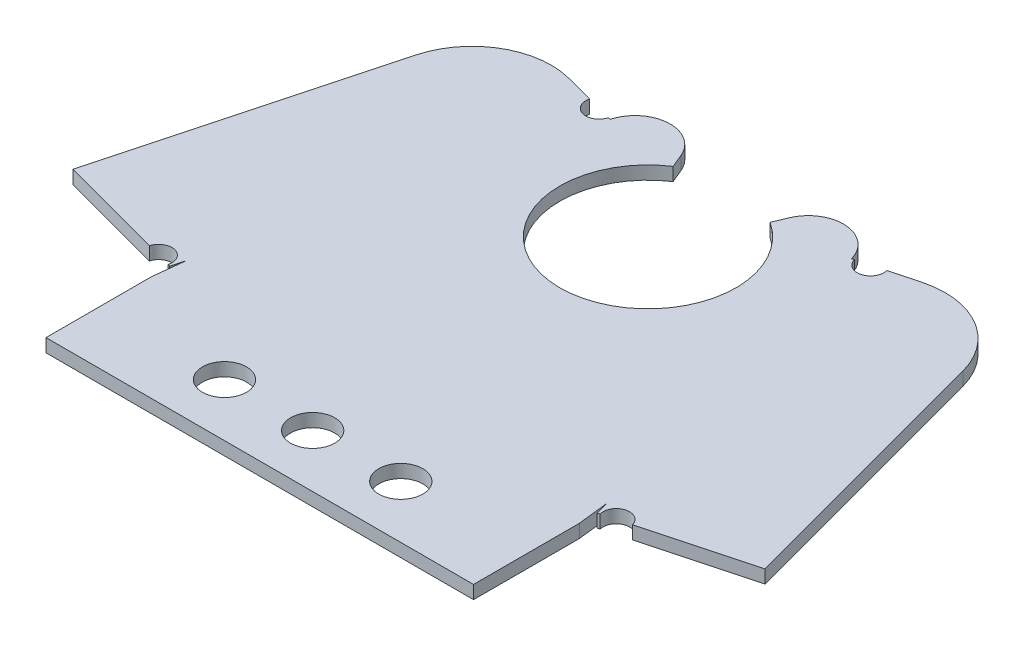
ISO-10303-21;
HEADER;
FILE_DESCRIPTION(('STEP AP214'),'2;1');
FILE_NAME('part.step','',(''),(''),'','','');
FILE_SCHEMA(('AUTOMOTIVE_DESIGN { 1 0 10303 214 1 1 1 1 }'));
ENDSEC;
DATA;
#1=APPLICATION_CONTEXT('core data for automotive mechanical design processes');
#2=APPLICATION_PROTOCOL_DEFINITION('international standard','automotive_design',2000,#1);
#3=PRODUCT_CONTEXT('',#1,'mechanical');
#4=PRODUCT('Part','Part','',(#3));
#5=PRODUCT_RELATED_PRODUCT_CATEGORY('part','',(#4));
#6=PRODUCT_DEFINITION_FORMATION('','',#4);
#7=PRODUCT_DEFINITION_CONTEXT('part definition',#1,'design');
#8=PRODUCT_DEFINITION('design','',#6,#7);
#9=PRODUCT_DEFINITION_SHAPE('','',#8);
#10=(LENGTH_UNIT() NAMED_UNIT(*) SI_UNIT(.MILLI.,.METRE.));
#11=(NAMED_UNIT(*) PLANE_ANGLE_UNIT() SI_UNIT($,.RADIAN.));
#12=(NAMED_UNIT(*) SI_UNIT($,.STERADIAN.) SOLID_ANGLE_UNIT());
#13=UNCERTAINTY_MEASURE_WITH_UNIT(LENGTH_MEASURE(1.E-05),#10,'distance_accuracy_value','');
#14=(GEOMETRIC_REPRESENTATION_CONTEXT(3) GLOBAL_UNCERTAINTY_ASSIGNED_CONTEXT((#13)) GLOBAL_UNIT_ASSIGNED_CONTEXT((#10,
#11,#12)) REPRESENTATION_CONTEXT('',''));
#15=CARTESIAN_POINT('',(0.,0.,0.));
#16=DIRECTION('',(0.,0.,1.));
#17=DIRECTION('',(1.,0.,0.));
#18=AXIS2_PLACEMENT_3D('',#15,#16,#17);
#19=CARTESIAN_POINT('',(-24.2469662427441,-0.75,30.));
#20=DIRECTION('',(-0.258819045102518,0.,0.965925826289069));
#21=DIRECTION('',(-0.965925826289069,0.,-0.258819045102518));
#22=AXIS2_PLACEMENT_3D('',#19,#20,#21);
#23=PLANE('',#22);
#24=DIRECTION('',(0.,1.,0.));
#25=VECTOR('',#24,1.);
#26=CARTESIAN_POINT('',(-24.5050093356881,-10.,29.9308575616332));
#27=LINE('',#26,#25);
#28=CARTESIAN_POINT('',(-24.5050093356881,-1.5,29.9308575616332));
#29=VERTEX_POINT('',#28);
#30=CARTESIAN_POINT('',(-24.5050093356881,0.,29.9308575616332));
#31=VERTEX_POINT('',#30);
#32=EDGE_CURVE('E13',#29,#31,#27,.T.);
#33=ORIENTED_EDGE('',*,*,#32,.F.);
#34=DIRECTION('',(-0.965925826289069,0.,-0.258819045102518));
#35=VECTOR('',#34,1.);
#36=CARTESIAN_POINT('',(-24.2469662427441,-1.5,30.));
#37=LINE('',#36,#35);
#38=CARTESIAN_POINT('',(-24.2469662427441,-1.5,30.));
#39=VERTEX_POINT('',#38);
#40=EDGE_CURVE('E342',#39,#29,#37,.T.);
#41=ORIENTED_EDGE('',*,*,#40,.F.);
#42=DIRECTION('',(0.,1.,0.));
#43=VECTOR('',#42,1.);
#44=CARTESIAN_POINT('',(-24.2469662427441,-1.5,30.));
#45=LINE('',#44,#43);
#46=CARTESIAN_POINT('',(-24.2469662427441,0.,30.));
#47=VERTEX_POINT('',#46);
#48=EDGE_CURVE('E474',#39,#47,#45,.T.);
#49=ORIENTED_EDGE('',*,*,#48,.T.);
#50=DIRECTION('',(-0.965925826289069,0.,-0.258819045102518));
#51=VECTOR('',#50,1.);
#52=CARTESIAN_POINT('',(-24.2469662427441,0.,30.));
#53=LINE('',#52,#51);
#54=EDGE_CURVE('E353',#47,#31,#53,.T.);
#55=ORIENTED_EDGE('',*,*,#54,.T.);
#56=EDGE_LOOP('',(#33,#41,#49,#55));
#57=FACE_BOUND('',#56,.T.);
#58=ADVANCED_FACE('F89',(#57),#23,.T.);
#59=CARTESIAN_POINT('',(-17.107135771081,-0.75,-10.3016647366962));
#60=DIRECTION('',(0.25881904510252,0.,-0.965925826289069));
#61=DIRECTION('',(0.965925826289069,0.,0.25881904510252));
#62=AXIS2_PLACEMENT_3D('',#59,#60,#61);
#63=PLANE('',#62);
#64=DIRECTION('',(0.,1.,0.));
#65=VECTOR('',#64,1.);
#66=CARTESIAN_POINT('',(-16.8490926781371,-10.,-10.2325222983294));
#67=LINE('',#66,#65);
#68=CARTESIAN_POINT('',(-16.8490926781371,-1.5,-10.2325222983294));
#69=VERTEX_POINT('',#68);
#70=CARTESIAN_POINT('',(-16.8490926781371,0.,-10.2325222983294));
#71=VERTEX_POINT('',#70);
#72=EDGE_CURVE('E534',#69,#71,#67,.T.);
#73=ORIENTED_EDGE('',*,*,#72,.F.);
#74=DIRECTION('',(0.965925826289069,0.,0.25881904510252));
#75=VECTOR('',#74,1.);
#76=CARTESIAN_POINT('',(-17.107135771081,-1.5,-10.3016647366962));
#77=LINE('',#76,#75);
#78=CARTESIAN_POINT('',(-20.0049132499483,-1.50000000000003,-11.0781218720038));
#79=VERTEX_POINT('',#78);
#80=EDGE_CURVE('E348',#79,#69,#77,.T.);
#81=ORIENTED_EDGE('',*,*,#80,.F.);
#82=DIRECTION('',(0.,1.,0.));
#83=VECTOR('',#82,1.);
#84=CARTESIAN_POINT('',(-20.0049132499483,-1.50000000000002,-11.0781218720038));
#85=LINE('',#84,#83);
#86=CARTESIAN_POINT('',(-20.0049132499483,0.,-11.0781218720038));
#87=VERTEX_POINT('',#86);
#88=EDGE_CURVE('E314',#79,#87,#85,.T.);
#89=ORIENTED_EDGE('',*,*,#88,.T.);
#90=DIRECTION('',(0.965925826289069,0.,0.25881904510252));
#91=VECTOR('',#90,1.);
#92=CARTESIAN_POINT('',(-17.107135771081,0.,-10.3016647366962));
#93=LINE('',#92,#91);
#94=EDGE_CURVE('E358',#87,#71,#93,.T.);
#95=ORIENTED_EDGE('',*,*,#94,.T.);
#96=EDGE_LOOP('',(#73,#81,#89,#95));
#97=FACE_BOUND('',#96,.T.);
#98=ADVANCED_FACE('F645',(#97),#63,.T.);
#99=CARTESIAN_POINT('',(13.6932721063258,-0.75,-9.38692272465511));
#100=DIRECTION('',(-0.258819045102521,0.,-0.965925826289068));
#101=DIRECTION('',(0.965925826289068,0.,-0.258819045102521));
#102=AXIS2_PLACEMENT_3D('',#99,#100,#101);
#103=PLANE('',#102);
#104=DIRECTION('',(0.,1.,0.));
#105=VECTOR('',#104,1.);
#106=CARTESIAN_POINT('',(13.9513151992698,-10.,-9.45606516302188));
#107=LINE('',#106,#105);
#108=CARTESIAN_POINT('',(13.9513151992698,-1.5,-9.45606516302188));
#109=VERTEX_POINT('',#108);
#110=CARTESIAN_POINT('',(13.9513151992698,0.,-9.45606516302188));
#111=VERTEX_POINT('',#110);
#112=EDGE_CURVE('E528',#109,#111,#107,.T.);
#113=ORIENTED_EDGE('',*,*,#112,.F.);
#114=DIRECTION('',(0.965925826289068,0.,-0.258819045102521));
#115=VECTOR('',#114,1.);
#116=CARTESIAN_POINT('',(13.6932721063258,-1.5,-9.38692272465511));
#117=LINE('',#116,#115);
#118=CARTESIAN_POINT('',(13.6932721063258,-1.50000000000001,-9.38692272465511));
#119=VERTEX_POINT('',#118);
#120=EDGE_CURVE('E308',#119,#109,#117,.T.);
#121=ORIENTED_EDGE('',*,*,#120,.F.);
#122=DIRECTION('',(0.,1.,0.));
#123=VECTOR('',#122,1.);
#124=CARTESIAN_POINT('',(13.6932721063258,-1.5,-9.38692272465511));
#125=LINE('',#124,#123);
#126=CARTESIAN_POINT('',(13.6932721063258,0.,-9.38692272465511));
#127=VERTEX_POINT('',#126);
#128=EDGE_CURVE('E483',#119,#127,#125,.T.);
#129=ORIENTED_EDGE('',*,*,#128,.T.);
#130=DIRECTION('',(0.965925826289068,0.,-0.258819045102521));
#131=VECTOR('',#130,1.);
#132=CARTESIAN_POINT('',(13.6932721063258,0.,-9.38692272465511));
#133=LINE('',#132,#131);
#134=EDGE_CURVE('E310',#127,#111,#133,.T.);
#135=ORIENTED_EDGE('',*,*,#134,.T.);
#136=EDGE_LOOP('',(#113,#121,#129,#135));
#137=FACE_BOUND('',#136,.T.);
#138=ADVANCED_FACE('F617',(#137),#103,.T.);
#139=CARTESIAN_POINT('',(27.6608299074993,-0.75,29.0852579879589));
#140=DIRECTION('',(0.258819045102513,0.,0.96592582628907));
#141=DIRECTION('',(-0.96592582628907,0.,0.258819045102513));
#142=AXIS2_PLACEMENT_3D('',#139,#140,#141);
#143=PLANE('',#142);
#144=DIRECTION('',(0.,1.,0.));
#145=VECTOR('',#144,1.);
#146=CARTESIAN_POINT('',(27.4027868145553,-10.,29.1544004263257));
#147=LINE('',#146,#145);
#148=CARTESIAN_POINT('',(27.4027868145553,-1.5,29.1544004263257));
#149=VERTEX_POINT('',#148);
#150=CARTESIAN_POINT('',(27.4027868145553,0.,29.1544004263257));
#151=VERTEX_POINT('',#150);
#152=EDGE_CURVE('E273',#149,#151,#147,.T.);
#153=ORIENTED_EDGE('',*,*,#152,.F.);
#154=DIRECTION('',(-0.96592582628907,0.,0.258819045102513));
#155=VECTOR('',#154,1.);
#156=CARTESIAN_POINT('',(27.6608299074993,-1.5,29.0852579879589));
#157=LINE('',#156,#155);
#158=CARTESIAN_POINT('',(39.2519398229682,-1.50000000000009,25.9794294467287));
#159=VERTEX_POINT('',#158);
#160=EDGE_CURVE('E341',#159,#149,#157,.T.);
#161=ORIENTED_EDGE('',*,*,#160,.F.);
#162=DIRECTION('',(0.,1.,0.));
#163=VECTOR('',#162,1.);
#164=CARTESIAN_POINT('',(39.2519398229682,-1.50000000000008,25.9794294467287));
#165=LINE('',#164,#163);
#166=CARTESIAN_POINT('',(39.2519398229682,0.,25.9794294467287));
#167=VERTEX_POINT('',#166);
#168=EDGE_CURVE('E302',#159,#167,#165,.T.);
#169=ORIENTED_EDGE('',*,*,#168,.T.);
#170=DIRECTION('',(-0.96592582628907,0.,0.258819045102513));
#171=VECTOR('',#170,1.);
#172=CARTESIAN_POINT('',(27.6608299074993,0.,29.0852579879589));
#173=LINE('',#172,#171);
#174=EDGE_CURVE('E292',#167,#151,#173,.T.);
#175=ORIENTED_EDGE('',*,*,#174,.T.);
#176=EDGE_LOOP('',(#153,#161,#169,#175));
#177=FACE_BOUND('',#176,.T.);
#178=ADVANCED_FACE('F300',(#177),#143,.T.);
#179=CARTESIAN_POINT('',(-9.82956880116958,-1.5,-8.35164654424503));
#180=DIRECTION('',(0.,-1.,0.));
#181=DIRECTION('',(0.,0.,-1.));
#182=AXIS2_PLACEMENT_3D('',#179,#180,#181);
#183=PLANE('',#182);
#184=CARTESIAN_POINT('',(-25.9538980751217,-1.5,29.5426289939795));
#185=DIRECTION('',(0.,-1.,0.));
#186=DIRECTION('',(0.,0.,-1.));
#187=AXIS2_PLACEMENT_3D('',#184,#185,#186);
#188=CIRCLE('',#187,1.5);
#189=CARTESIAN_POINT('',(-27.4027868145553,-1.50000000000009,29.1544004263257));
#190=VERTEX_POINT('',#189);
#191=EDGE_CURVE('E539',#190,#29,#188,.T.);
#192=ORIENTED_EDGE('',*,*,#191,.F.);
#193=CARTESIAN_POINT('',(-39.2519398229682,-1.50000000000009,25.9794294467287));
#194=VERTEX_POINT('',#193);
#195=EDGE_CURVE('E347',#190,#194,#37,.T.);
#196=ORIENTED_EDGE('',*,*,#195,.T.);
#197=DIRECTION('',(0.258819045102518,0.,-0.965925826289069));
#198=VECTOR('',#197,1.);
#199=CARTESIAN_POINT('',(-30.1277010670563,-1.50000000000009,-8.07269317072392));
#200=LINE('',#199,#198);
#201=CARTESIAN_POINT('',(-31.0276170924726,-1.50000000000009,-4.71416084132481));
#202=VERTEX_POINT('',#201);
#203=EDGE_CURVE('E326',#194,#202,#200,.T.);
#204=ORIENTED_EDGE('',*,*,#203,.T.);
#205=CARTESIAN_POINT('',(-22.3342846558709,-1.50000000000003,-2.38478943540215));
#206=DIRECTION('',(0.,1.,0.));
#207=DIRECTION('',(0.258819045102518,0.,-0.965925826289069));
#208=AXIS2_PLACEMENT_3D('',#205,#206,#207);
#209=CIRCLE('',#208,9.);
#210=EDGE_CURVE('E322',#202,#79,#209,.F.);
#211=ORIENTED_EDGE('',*,*,#210,.T.);
#212=ORIENTED_EDGE('',*,*,#80,.T.);
#213=CARTESIAN_POINT('',(-15.4002039387034,-1.5,-9.84429373067566));
#214=DIRECTION('',(0.,-1.,0.));
#215=DIRECTION('',(0.,0.,-1.));
#216=AXIS2_PLACEMENT_3D('',#213,#214,#215);
#217=CIRCLE('',#216,1.5);
#218=CARTESIAN_POINT('',(-13.9513151992698,-1.50000000000003,-9.45606516302188));
#219=VERTEX_POINT('',#218);
#220=EDGE_CURVE('E550',#219,#69,#217,.T.);
#221=ORIENTED_EDGE('',*,*,#220,.F.);
#222=CARTESIAN_POINT('',(-13.6932721063258,-1.5,-9.3869227246551));
#223=VERTEX_POINT('',#222);
#224=EDGE_CURVE('E346',#219,#223,#77,.T.);
#225=ORIENTED_EDGE('',*,*,#224,.T.);
#226=CARTESIAN_POINT('',(-9.82956880116958,-1.5,-8.35164654424503));
#227=DIRECTION('',(0.,1.,0.));
#228=DIRECTION('',(0.,0.,-1.));
#229=AXIS2_PLACEMENT_3D('',#226,#227,#228);
#230=CIRCLE('',#229,4.);
#231=CARTESIAN_POINT('',(-6.13405067112442,-1.5,-9.88238027370538));
#232=VERTEX_POINT('',#231);
#233=EDGE_CURVE('E437',#232,#223,#230,.T.);
#234=ORIENTED_EDGE('',*,*,#233,.F.);
#235=DIRECTION('',(-0.382683432365089,0.,-0.923879532511287));
#236=VECTOR('',#235,1.);
#237=CARTESIAN_POINT('',(-6.13405067112442,-1.5,-9.88238027370538));
#238=LINE('',#237,#236);
#239=CARTESIAN_POINT('',(-5.5,-1.5,-8.35164654424503));
#240=VERTEX_POINT('',#239);
#241=EDGE_CURVE('E433',#240,#232,#238,.T.);
#242=ORIENTED_EDGE('',*,*,#241,.F.);
#243=CARTESIAN_POINT('',(0.,-1.5,0.));
#244=DIRECTION('',(0.,-1.,0.));
#245=DIRECTION('',(0.,0.,1.));
#246=AXIS2_PLACEMENT_3D('',#243,#244,#245);
#247=CIRCLE('',#246,10.);
#248=CARTESIAN_POINT('',(5.5,-1.5,-8.35164654424503));
#249=VERTEX_POINT('',#248);
#250=EDGE_CURVE('E429',#249,#240,#247,.T.);
#251=ORIENTED_EDGE('',*,*,#250,.F.);
#252=DIRECTION('',(-0.382683432365088,0.,0.923879532511287));
#253=VECTOR('',#252,1.);
#254=CARTESIAN_POINT('',(5.5,-1.5,-8.35164654424503));
#255=LINE('',#254,#253);
#256=CARTESIAN_POINT('',(6.13405067112442,-1.5,-9.88238027370538));
#257=VERTEX_POINT('',#256);
#258=EDGE_CURVE('E424',#257,#249,#255,.T.);
#259=ORIENTED_EDGE('',*,*,#258,.F.);
#260=CARTESIAN_POINT('',(9.82956880116957,-1.5,-8.35164654424503));
#261=DIRECTION('',(0.,1.,0.));
#262=DIRECTION('',(0.,0.,-1.));
#263=AXIS2_PLACEMENT_3D('',#260,#261,#262);
#264=CIRCLE('',#263,4.);
#265=EDGE_CURVE('E420',#119,#257,#264,.T.);
#266=ORIENTED_EDGE('',*,*,#265,.F.);
#267=ORIENTED_EDGE('',*,*,#120,.T.);
#268=CARTESIAN_POINT('',(15.4002039387034,-1.5,-9.84429373067567));
#269=DIRECTION('',(0.,-1.,0.));
#270=DIRECTION('',(0.,0.,-1.));
#271=AXIS2_PLACEMENT_3D('',#268,#269,#270);
#272=CIRCLE('',#271,1.5);
#273=CARTESIAN_POINT('',(16.8490926781371,-1.50000000000003,-10.2325222983294));
#274=VERTEX_POINT('',#273);
#275=EDGE_CURVE('E592',#274,#109,#272,.T.);
#276=ORIENTED_EDGE('',*,*,#275,.F.);
#277=CARTESIAN_POINT('',(20.0049132499483,-1.50000000000003,-11.0781218720038));
#278=VERTEX_POINT('',#277);
#279=EDGE_CURVE('E304',#274,#278,#117,.T.);
#280=ORIENTED_EDGE('',*,*,#279,.T.);
#281=CARTESIAN_POINT('',(22.3342846558709,-1.50000000000003,-2.38478943540214));
#282=DIRECTION('',(0.,1.,0.));
#283=DIRECTION('',(0.258819045102518,0.,0.965925826289069));
#284=AXIS2_PLACEMENT_3D('',#281,#282,#283);
#285=CIRCLE('',#284,9.);
#286=CARTESIAN_POINT('',(31.0276170924725,-1.50000000000009,-4.71416084132481));
#287=VERTEX_POINT('',#286);
#288=EDGE_CURVE('E572',#278,#287,#285,.F.);
#289=ORIENTED_EDGE('',*,*,#288,.T.);
#290=DIRECTION('',(0.258819045102518,0.,0.965925826289069));
#291=VECTOR('',#290,1.);
#292=CARTESIAN_POINT('',(30.1277010670562,-1.50000000000009,-8.07269317072392));
#293=LINE('',#292,#291);
#294=EDGE_CURVE('E575',#287,#159,#293,.T.);
#295=ORIENTED_EDGE('',*,*,#294,.T.);
#296=ORIENTED_EDGE('',*,*,#160,.T.);
#297=CARTESIAN_POINT('',(25.9538980751217,-1.5,29.5426289939795));
#298=DIRECTION('',(0.,-1.,0.));
#299=DIRECTION('',(0.,0.,-1.));
#300=AXIS2_PLACEMENT_3D('',#297,#298,#299);
#301=CIRCLE('',#300,1.5);
#302=CARTESIAN_POINT('',(24.5050093356881,-1.50000000000009,29.9308575616332));
#303=VERTEX_POINT('',#302);
#304=EDGE_CURVE('E279',#303,#149,#301,.T.);
#305=ORIENTED_EDGE('',*,*,#304,.F.);
#306=CARTESIAN_POINT('',(24.2469662427441,-1.5,30.));
#307=VERTEX_POINT('',#306);
#308=EDGE_CURVE('E560',#303,#307,#157,.T.);
#309=ORIENTED_EDGE('',*,*,#308,.T.);
#310=DIRECTION('',(-0.258819045102519,0.,-0.965925826289069));
#311=VECTOR('',#310,1.);
#312=CARTESIAN_POINT('',(16.2084904698105,-1.5,0.));
#313=LINE('',#312,#311);
#314=CARTESIAN_POINT('',(23.8450424540974,-1.5,28.5));
#315=VERTEX_POINT('',#314);
#316=EDGE_CURVE('E508',#307,#315,#313,.T.);
#317=ORIENTED_EDGE('',*,*,#316,.T.);
#318=DIRECTION('',(0.112992875932031,0.,0.993595798093273));
#319=VECTOR('',#318,1.);
#320=CARTESIAN_POINT('',(23.8450424540974,-1.5,28.5));
#321=LINE('',#320,#319);
#322=CARTESIAN_POINT('',(24.2469662427441,-1.5,32.0342917352885));
#323=VERTEX_POINT('',#322);
#324=EDGE_CURVE('E486',#315,#323,#321,.T.);
#325=ORIENTED_EDGE('',*,*,#324,.T.);
#326=DIRECTION('',(0.,0.,1.));
#327=VECTOR('',#326,1.);
#328=CARTESIAN_POINT('',(24.2469662427441,-1.50000000000005,44.0342917352885));
#329=LINE('',#328,#327);
#330=CARTESIAN_POINT('',(24.2469662427441,-1.50000000000005,44.0342917352885));
#331=VERTEX_POINT('',#330);
#332=EDGE_CURVE('E383',#323,#331,#329,.T.);
#333=ORIENTED_EDGE('',*,*,#332,.T.);
#334=DIRECTION('',(-1.,0.,0.));
#335=VECTOR('',#334,1.);
#336=CARTESIAN_POINT('',(-24.2469662427441,-1.50000000000005,44.0342917352885));
#337=LINE('',#336,#335);
#338=CARTESIAN_POINT('',(-24.2469662427441,-1.50000000000005,44.0342917352885));
#339=VERTEX_POINT('',#338);
#340=EDGE_CURVE('E380',#331,#339,#337,.T.);
#341=ORIENTED_EDGE('',*,*,#340,.T.);
#342=DIRECTION('',(0.,0.,-1.));
#343=VECTOR('',#342,1.);
#344=CARTESIAN_POINT('',(-24.2469662427441,-1.5,30.5342917352885));
#345=LINE('',#344,#343);
#346=CARTESIAN_POINT('',(-24.2469662427441,-1.5,32.0342917352885));
#347=VERTEX_POINT('',#346);
#348=EDGE_CURVE('E377',#339,#347,#345,.T.);
#349=ORIENTED_EDGE('',*,*,#348,.T.);
#350=DIRECTION('',(0.112992875932035,0.,-0.993595798093273));
#351=VECTOR('',#350,1.);
#352=CARTESIAN_POINT('',(-24.2469662427441,-1.5,32.0342917352885));
#353=LINE('',#352,#351);
#354=CARTESIAN_POINT('',(-23.8450424540974,-1.5,28.5));
#355=VERTEX_POINT('',#354);
#356=EDGE_CURVE('E447',#347,#355,#353,.T.);
#357=ORIENTED_EDGE('',*,*,#356,.T.);
#358=DIRECTION('',(-0.258819045102518,0.,0.965925826289069));
#359=VECTOR('',#358,1.);
#360=CARTESIAN_POINT('',(-24.2469662427441,-1.50000000000002,30.));
#361=LINE('',#360,#359);
#362=EDGE_CURVE('E478',#355,#39,#361,.T.);
#363=ORIENTED_EDGE('',*,*,#362,.T.);
#364=ORIENTED_EDGE('',*,*,#40,.T.);
#365=EDGE_LOOP('',(#192,#196,#204,#211,#212,#221,#225,#234,#242,#251,#259,#266,#267,#276,#280,
#289,#295,#296,#305,#309,#317,#325,#333,#341,#349,#357,#363,#364));
#366=FACE_BOUND('',#365,.T.);
#367=CARTESIAN_POINT('',(9.99999999999999,-1.50000000000003,38.0342917352885));
#368=DIRECTION('',(0.,-1.,0.));
#369=DIRECTION('',(1.,0.,0.));
#370=AXIS2_PLACEMENT_3D('',#367,#368,#369);
#371=CIRCLE('',#370,2.5);
#372=CARTESIAN_POINT('',(12.5,-1.50000000000003,38.0342917352885));
#373=VERTEX_POINT('',#372);
#374=EDGE_CURVE('E386',#373,#373,#371,.T.);
#375=ORIENTED_EDGE('',*,*,#374,.F.);
#376=EDGE_LOOP('',(#375));
#377=FACE_BOUND('',#376,.T.);
#378=CARTESIAN_POINT('',(-10.,-1.50000000000003,38.0342917352885));
#379=DIRECTION('',(0.,-1.,0.));
#380=DIRECTION('',(1.,0.,0.));
#381=AXIS2_PLACEMENT_3D('',#378,#379,#380);
#382=CIRCLE('',#381,2.5);
#383=CARTESIAN_POINT('',(-7.50000000000001,-1.50000000000003,38.0342917352885));
#384=VERTEX_POINT('',#383);
#385=EDGE_CURVE('E394',#384,#384,#382,.T.);
#386=ORIENTED_EDGE('',*,*,#385,.F.);
#387=EDGE_LOOP('',(#386));
#388=FACE_BOUND('',#387,.T.);
#389=CARTESIAN_POINT('',(0.,-1.50000000000003,38.0342917352885));
#390=DIRECTION('',(0.,-1.,0.));
#391=DIRECTION('',(1.,0.,0.));
#392=AXIS2_PLACEMENT_3D('',#389,#390,#391);
#393=CIRCLE('',#392,2.5);
#394=CARTESIAN_POINT('',(2.49999999999999,-1.50000000000003,38.0342917352885));
#395=VERTEX_POINT('',#394);
#396=EDGE_CURVE('E402',#395,#395,#393,.T.);
#397=ORIENTED_EDGE('',*,*,#396,.F.);
#398=EDGE_LOOP('',(#397));
#399=FACE_BOUND('',#398,.T.);
#400=ADVANCED_FACE('F544',(#366,#377,#388,#399),#183,.T.);
#401=CARTESIAN_POINT('',(-9.82956880116958,0.,-8.35164654424503));
#402=DIRECTION('',(0.,-1.,0.));
#403=DIRECTION('',(0.,0.,-1.));
#404=AXIS2_PLACEMENT_3D('',#401,#402,#403);
#405=PLANE('',#404);
#406=CARTESIAN_POINT('',(-27.4027868145553,0.,29.1544004263257));
#407=VERTEX_POINT('',#406);
#408=CARTESIAN_POINT('',(-39.2519398229682,0.,25.9794294467287));
#409=VERTEX_POINT('',#408);
#410=EDGE_CURVE('E318',#407,#409,#53,.T.);
#411=ORIENTED_EDGE('',*,*,#410,.F.);
#412=CARTESIAN_POINT('',(-25.9538980751217,0.,29.5426289939795));
#413=DIRECTION('',(0.,1.,0.));
#414=DIRECTION('',(0.,0.,1.));
#415=AXIS2_PLACEMENT_3D('',#412,#413,#414);
#416=CIRCLE('',#415,1.5);
#417=EDGE_CURVE('E104',#31,#407,#416,.T.);
#418=ORIENTED_EDGE('',*,*,#417,.F.);
#419=ORIENTED_EDGE('',*,*,#54,.F.);
#420=DIRECTION('',(-0.258819045102519,0.,0.965925826289069));
#421=VECTOR('',#420,1.);
#422=CARTESIAN_POINT('',(-23.8450424540974,0.,28.5));
#423=LINE('',#422,#421);
#424=CARTESIAN_POINT('',(-23.8450424540974,0.,28.5));
#425=VERTEX_POINT('',#424);
#426=EDGE_CURVE('E477',#425,#47,#423,.T.);
#427=ORIENTED_EDGE('',*,*,#426,.F.);
#428=DIRECTION('',(0.112992875932035,0.,-0.993595798093273));
#429=VECTOR('',#428,1.);
#430=CARTESIAN_POINT('',(-24.2469662427441,0.,32.0342917352885));
#431=LINE('',#430,#429);
#432=CARTESIAN_POINT('',(-24.2469662427441,0.,32.0342917352885));
#433=VERTEX_POINT('',#432);
#434=EDGE_CURVE('E496',#433,#425,#431,.T.);
#435=ORIENTED_EDGE('',*,*,#434,.F.);
#436=DIRECTION('',(0.,0.,-1.));
#437=VECTOR('',#436,1.);
#438=CARTESIAN_POINT('',(-24.2469662427441,0.,30.5342917352885));
#439=LINE('',#438,#437);
#440=CARTESIAN_POINT('',(-24.2469662427441,0.,44.0342917352885));
#441=VERTEX_POINT('',#440);
#442=EDGE_CURVE('E362',#441,#433,#439,.T.);
#443=ORIENTED_EDGE('',*,*,#442,.F.);
#444=DIRECTION('',(-1.,0.,0.));
#445=VECTOR('',#444,1.);
#446=CARTESIAN_POINT('',(-24.2469662427441,0.,44.0342917352885));
#447=LINE('',#446,#445);
#448=CARTESIAN_POINT('',(24.2469662427441,0.,44.0342917352885));
#449=VERTEX_POINT('',#448);
#450=EDGE_CURVE('E414',#449,#441,#447,.T.);
#451=ORIENTED_EDGE('',*,*,#450,.F.);
#452=DIRECTION('',(0.,0.,1.));
#453=VECTOR('',#452,1.);
#454=CARTESIAN_POINT('',(24.2469662427441,0.,44.0342917352885));
#455=LINE('',#454,#453);
#456=CARTESIAN_POINT('',(24.2469662427441,0.,32.0342917352885));
#457=VERTEX_POINT('',#456);
#458=EDGE_CURVE('E374',#457,#449,#455,.T.);
#459=ORIENTED_EDGE('',*,*,#458,.F.);
#460=DIRECTION('',(0.112992875932031,0.,0.993595798093273));
#461=VECTOR('',#460,1.);
#462=CARTESIAN_POINT('',(23.8450424540974,0.,28.5));
#463=LINE('',#462,#461);
#464=CARTESIAN_POINT('',(23.8450424540974,0.,28.5));
#465=VERTEX_POINT('',#464);
#466=EDGE_CURVE('E365',#465,#457,#463,.T.);
#467=ORIENTED_EDGE('',*,*,#466,.F.);
#468=DIRECTION('',(-0.258819045102519,0.,-0.965925826289069));
#469=VECTOR('',#468,1.);
#470=CARTESIAN_POINT('',(13.6932721063258,0.,-9.38692272465511));
#471=LINE('',#470,#469);
#472=CARTESIAN_POINT('',(24.2469662427441,0.,30.));
#473=VERTEX_POINT('',#472);
#474=EDGE_CURVE('E503',#473,#465,#471,.T.);
#475=ORIENTED_EDGE('',*,*,#474,.F.);
#476=CARTESIAN_POINT('',(24.5050093356881,0.,29.9308575616332));
#477=VERTEX_POINT('',#476);
#478=EDGE_CURVE('E295',#477,#473,#173,.T.);
#479=ORIENTED_EDGE('',*,*,#478,.F.);
#480=CARTESIAN_POINT('',(25.9538980751217,0.,29.5426289939795));
#481=DIRECTION('',(0.,1.,0.));
#482=DIRECTION('',(0.,0.,1.));
#483=AXIS2_PLACEMENT_3D('',#480,#481,#482);
#484=CIRCLE('',#483,1.5);
#485=EDGE_CURVE('E276',#151,#477,#484,.T.);
#486=ORIENTED_EDGE('',*,*,#485,.F.);
#487=ORIENTED_EDGE('',*,*,#174,.F.);
#488=DIRECTION('',(-0.258819045102518,0.,-0.965925826289069));
#489=VECTOR('',#488,1.);
#490=CARTESIAN_POINT('',(39.2519398229682,0.,25.9794294467287));
#491=LINE('',#490,#489);
#492=CARTESIAN_POINT('',(31.0276170924725,0.,-4.71416084132481));
#493=VERTEX_POINT('',#492);
#494=EDGE_CURVE('E569',#493,#167,#491,.F.);
#495=ORIENTED_EDGE('',*,*,#494,.F.);
#496=CARTESIAN_POINT('',(22.3342846558709,0.,-2.38478943540215));
#497=DIRECTION('',(0.,1.,0.));
#498=DIRECTION('',(0.258819045102518,0.,0.965925826289069));
#499=AXIS2_PLACEMENT_3D('',#496,#497,#498);
#500=CIRCLE('',#499,9.);
#501=CARTESIAN_POINT('',(20.0049132499483,0.,-11.0781218720038));
#502=VERTEX_POINT('',#501);
#503=EDGE_CURVE('E583',#493,#502,#500,.T.);
#504=ORIENTED_EDGE('',*,*,#503,.T.);
#505=CARTESIAN_POINT('',(16.8490926781371,0.,-10.2325222983294));
#506=VERTEX_POINT('',#505);
#507=EDGE_CURVE('E588',#506,#502,#133,.T.);
#508=ORIENTED_EDGE('',*,*,#507,.F.);
#509=CARTESIAN_POINT('',(15.4002039387034,0.,-9.84429373067567));
#510=DIRECTION('',(0.,1.,0.));
#511=DIRECTION('',(0.,0.,1.));
#512=AXIS2_PLACEMENT_3D('',#509,#510,#511);
#513=CIRCLE('',#512,1.5);
#514=EDGE_CURVE('E297',#111,#506,#513,.T.);
#515=ORIENTED_EDGE('',*,*,#514,.F.);
#516=ORIENTED_EDGE('',*,*,#134,.F.);
#517=CARTESIAN_POINT('',(9.82956880116957,0.,-8.35164654424503));
#518=DIRECTION('',(0.,1.,0.));
#519=DIRECTION('',(0.,0.,-1.));
#520=AXIS2_PLACEMENT_3D('',#517,#518,#519);
#521=CIRCLE('',#520,4.);
#522=CARTESIAN_POINT('',(6.13405067112442,0.,-9.88238027370538));
#523=VERTEX_POINT('',#522);
#524=EDGE_CURVE('E442',#127,#523,#521,.T.);
#525=ORIENTED_EDGE('',*,*,#524,.T.);
#526=DIRECTION('',(-0.382683432365088,0.,0.923879532511287));
#527=VECTOR('',#526,1.);
#528=CARTESIAN_POINT('',(5.5,0.,-8.35164654424503));
#529=LINE('',#528,#527);
#530=CARTESIAN_POINT('',(5.5,0.,-8.35164654424503));
#531=VERTEX_POINT('',#530);
#532=EDGE_CURVE('E446',#523,#531,#529,.T.);
#533=ORIENTED_EDGE('',*,*,#532,.T.);
#534=CARTESIAN_POINT('',(0.,0.,0.));
#535=DIRECTION('',(0.,-1.,0.));
#536=DIRECTION('',(0.,0.,1.));
#537=AXIS2_PLACEMENT_3D('',#534,#535,#536);
#538=CIRCLE('',#537,10.);
#539=CARTESIAN_POINT('',(-5.5,0.,-8.35164654424503));
#540=VERTEX_POINT('',#539);
#541=EDGE_CURVE('E451',#531,#540,#538,.T.);
#542=ORIENTED_EDGE('',*,*,#541,.T.);
#543=DIRECTION('',(-0.382683432365089,0.,-0.923879532511287));
#544=VECTOR('',#543,1.);
#545=CARTESIAN_POINT('',(-6.13405067112442,0.,-9.88238027370538));
#546=LINE('',#545,#544);
#547=CARTESIAN_POINT('',(-6.13405067112442,0.,-9.88238027370538));
#548=VERTEX_POINT('',#547);
#549=EDGE_CURVE('E455',#540,#548,#546,.T.);
#550=ORIENTED_EDGE('',*,*,#549,.T.);
#551=CARTESIAN_POINT('',(-9.82956880116958,0.,-8.35164654424503));
#552=DIRECTION('',(0.,1.,0.));
#553=DIRECTION('',(0.,0.,-1.));
#554=AXIS2_PLACEMENT_3D('',#551,#552,#553);
#555=CIRCLE('',#554,4.);
#556=CARTESIAN_POINT('',(-13.6932721063258,0.,-9.38692272465511));
#557=VERTEX_POINT('',#556);
#558=EDGE_CURVE('E425',#548,#557,#555,.T.);
#559=ORIENTED_EDGE('',*,*,#558,.T.);
#560=CARTESIAN_POINT('',(-13.9513151992698,0.,-9.45606516302188));
#561=VERTEX_POINT('',#560);
#562=EDGE_CURVE('E357',#561,#557,#93,.T.);
#563=ORIENTED_EDGE('',*,*,#562,.F.);
#564=CARTESIAN_POINT('',(-15.4002039387034,0.,-9.84429373067566));
#565=DIRECTION('',(0.,1.,0.));
#566=DIRECTION('',(0.,0.,1.));
#567=AXIS2_PLACEMENT_3D('',#564,#565,#566);
#568=CIRCLE('',#567,1.5);
#569=EDGE_CURVE('E112',#71,#561,#568,.T.);
#570=ORIENTED_EDGE('',*,*,#569,.F.);
#571=ORIENTED_EDGE('',*,*,#94,.F.);
#572=CARTESIAN_POINT('',(-22.3342846558709,0.,-2.38478943540215));
#573=DIRECTION('',(0.,1.,0.));
#574=DIRECTION('',(0.258819045102518,0.,-0.965925826289069));
#575=AXIS2_PLACEMENT_3D('',#572,#573,#574);
#576=CIRCLE('',#575,9.);
#577=CARTESIAN_POINT('',(-31.0276170924726,0.,-4.71416084132482));
#578=VERTEX_POINT('',#577);
#579=EDGE_CURVE('E319',#87,#578,#576,.T.);
#580=ORIENTED_EDGE('',*,*,#579,.T.);
#581=DIRECTION('',(-0.258819045102518,0.,0.965925826289069));
#582=VECTOR('',#581,1.);
#583=CARTESIAN_POINT('',(-28.6982456865499,0.,-13.4074932779264));
#584=LINE('',#583,#582);
#585=EDGE_CURVE('E337',#409,#578,#584,.F.);
#586=ORIENTED_EDGE('',*,*,#585,.F.);
#587=EDGE_LOOP('',(#411,#418,#419,#427,#435,#443,#451,#459,#467,#475,#479,#486,#487,#495,#504,
#508,#515,#516,#525,#533,#542,#550,#559,#563,#570,#571,#580,#586));
#588=FACE_BOUND('',#587,.T.);
#589=CARTESIAN_POINT('',(9.99999999999999,0.,38.0342917352885));
#590=DIRECTION('',(0.,1.,0.));
#591=DIRECTION('',(-1.,0.,0.));
#592=AXIS2_PLACEMENT_3D('',#589,#590,#591);
#593=CIRCLE('',#592,2.5);
#594=CARTESIAN_POINT('',(7.49999999999999,0.,38.0342917352885));
#595=VERTEX_POINT('',#594);
#596=EDGE_CURVE('E390',#595,#595,#593,.T.);
#597=ORIENTED_EDGE('',*,*,#596,.F.);
#598=EDGE_LOOP('',(#597));
#599=FACE_BOUND('',#598,.T.);
#600=CARTESIAN_POINT('',(-10.,0.,38.0342917352885));
#601=DIRECTION('',(0.,1.,0.));
#602=DIRECTION('',(-1.,0.,0.));
#603=AXIS2_PLACEMENT_3D('',#600,#601,#602);
#604=CIRCLE('',#603,2.5);
#605=CARTESIAN_POINT('',(-12.5,0.,38.0342917352885));
#606=VERTEX_POINT('',#605);
#607=EDGE_CURVE('E398',#606,#606,#604,.T.);
#608=ORIENTED_EDGE('',*,*,#607,.F.);
#609=EDGE_LOOP('',(#608));
#610=FACE_BOUND('',#609,.T.);
#611=CARTESIAN_POINT('',(0.,0.,38.0342917352885));
#612=DIRECTION('',(0.,1.,0.));
#613=DIRECTION('',(-1.,0.,0.));
#614=AXIS2_PLACEMENT_3D('',#611,#612,#613);
#615=CIRCLE('',#614,2.5);
#616=CARTESIAN_POINT('',(-2.50000000000001,0.,38.0342917352885));
#617=VERTEX_POINT('',#616);
#618=EDGE_CURVE('E406',#617,#617,#615,.T.);
#619=ORIENTED_EDGE('',*,*,#618,.F.);
#620=EDGE_LOOP('',(#619));
#621=FACE_BOUND('',#620,.T.);
#622=ADVANCED_FACE('F91',(#588,#599,#610,#621),#405,.F.);
#623=CARTESIAN_POINT('',(-9.82956880116958,-1.5,-8.35164654424503));
#624=DIRECTION('',(0.,1.,0.));
#625=DIRECTION('',(0.,0.,1.));
#626=AXIS2_PLACEMENT_3D('',#623,#624,#625);
#627=CYLINDRICAL_SURFACE('',#626,4.);
#628=ORIENTED_EDGE('',*,*,#558,.F.);
#629=DIRECTION('',(0.,1.,0.));
#630=VECTOR('',#629,1.);
#631=CARTESIAN_POINT('',(-6.13405067112442,-1.5,-9.88238027370538));
#632=LINE('',#631,#630);
#633=EDGE_CURVE('E462',#232,#548,#632,.T.);
#634=ORIENTED_EDGE('',*,*,#633,.F.);
#635=ORIENTED_EDGE('',*,*,#233,.T.);
#636=DIRECTION('',(0.,1.,0.));
#637=VECTOR('',#636,1.);
#638=CARTESIAN_POINT('',(-13.6932721063258,-1.5,-9.38692272465511));
#639=LINE('',#638,#637);
#640=EDGE_CURVE('E479',#223,#557,#639,.T.);
#641=ORIENTED_EDGE('',*,*,#640,.T.);
#642=EDGE_LOOP('',(#628,#634,#635,#641));
#643=FACE_BOUND('',#642,.T.);
#644=ADVANCED_FACE('F637',(#643),#627,.T.);
#645=CARTESIAN_POINT('',(-6.13405067112442,-1.5,-9.88238027370538));
#646=DIRECTION('',(0.923879532511287,0.,-0.382683432365089));
#647=DIRECTION('',(-0.382683432365089,0.,-0.923879532511287));
#648=AXIS2_PLACEMENT_3D('',#645,#646,#647);
#649=PLANE('',#648);
#650=ORIENTED_EDGE('',*,*,#549,.F.);
#651=DIRECTION('',(0.,1.,0.));
#652=VECTOR('',#651,1.);
#653=CARTESIAN_POINT('',(-5.5,-1.5,-8.35164654424503));
#654=LINE('',#653,#652);
#655=EDGE_CURVE('E466',#240,#540,#654,.T.);
#656=ORIENTED_EDGE('',*,*,#655,.F.);
#657=ORIENTED_EDGE('',*,*,#241,.T.);
#658=ORIENTED_EDGE('',*,*,#633,.T.);
#659=EDGE_LOOP('',(#650,#656,#657,#658));
#660=FACE_BOUND('',#659,.T.);
#661=ADVANCED_FACE('F633',(#660),#649,.T.);
#662=CARTESIAN_POINT('',(0.,-1.5,0.));
#663=DIRECTION('',(0.,1.,0.));
#664=DIRECTION('',(0.,0.,1.));
#665=AXIS2_PLACEMENT_3D('',#662,#663,#664);
#666=CYLINDRICAL_SURFACE('',#665,10.);
#667=ORIENTED_EDGE('',*,*,#541,.F.);
#668=DIRECTION('',(0.,1.,0.));
#669=VECTOR('',#668,1.);
#670=CARTESIAN_POINT('',(5.5,-1.5,-8.35164654424503));
#671=LINE('',#670,#669);
#672=EDGE_CURVE('E469',#249,#531,#671,.T.);
#673=ORIENTED_EDGE('',*,*,#672,.F.);
#674=ORIENTED_EDGE('',*,*,#250,.T.);
#675=ORIENTED_EDGE('',*,*,#655,.T.);
#676=EDGE_LOOP('',(#667,#673,#674,#675));
#677=FACE_BOUND('',#676,.T.);
#678=ADVANCED_FACE('F628',(#677),#666,.F.);
#679=CARTESIAN_POINT('',(5.5,-1.5,-8.35164654424503));
#680=DIRECTION('',(-0.923879532511287,0.,-0.382683432365089));
#681=DIRECTION('',(-0.382683432365089,0.,0.923879532511287));
#682=AXIS2_PLACEMENT_3D('',#679,#680,#681);
#683=PLANE('',#682);
#684=ORIENTED_EDGE('',*,*,#532,.F.);
#685=DIRECTION('',(0.,1.,0.));
#686=VECTOR('',#685,1.);
#687=CARTESIAN_POINT('',(6.13405067112442,-1.5,-9.88238027370538));
#688=LINE('',#687,#686);
#689=EDGE_CURVE('E441',#257,#523,#688,.T.);
#690=ORIENTED_EDGE('',*,*,#689,.F.);
#691=ORIENTED_EDGE('',*,*,#258,.T.);
#692=ORIENTED_EDGE('',*,*,#672,.T.);
#693=EDGE_LOOP('',(#684,#690,#691,#692));
#694=FACE_BOUND('',#693,.T.);
#695=ADVANCED_FACE('F624',(#694),#683,.T.);
#696=CARTESIAN_POINT('',(9.82956880116957,-1.5,-8.35164654424503));
#697=DIRECTION('',(0.,1.,0.));
#698=DIRECTION('',(0.,0.,1.));
#699=AXIS2_PLACEMENT_3D('',#696,#697,#698);
#700=CYLINDRICAL_SURFACE('',#699,4.);
#701=ORIENTED_EDGE('',*,*,#524,.F.);
#702=ORIENTED_EDGE('',*,*,#128,.F.);
#703=ORIENTED_EDGE('',*,*,#265,.T.);
#704=ORIENTED_EDGE('',*,*,#689,.T.);
#705=EDGE_LOOP('',(#701,#702,#703,#704));
#706=FACE_BOUND('',#705,.T.);
#707=ADVANCED_FACE('F621',(#706),#700,.T.);
#708=CARTESIAN_POINT('',(24.2469662427441,0.,30.));
#709=DIRECTION('',(-0.965925826289069,0.,0.258819045102519));
#710=DIRECTION('',(0.258819045102519,0.,0.965925826289069));
#711=AXIS2_PLACEMENT_3D('',#708,#709,#710);
#712=PLANE('',#711);
#713=ORIENTED_EDGE('',*,*,#316,.F.);
#714=DIRECTION('',(0.,1.,0.));
#715=VECTOR('',#714,1.);
#716=CARTESIAN_POINT('',(24.2469662427441,-1.5,30.));
#717=LINE('',#716,#715);
#718=EDGE_CURVE('E504',#307,#473,#717,.T.);
#719=ORIENTED_EDGE('',*,*,#718,.T.);
#720=ORIENTED_EDGE('',*,*,#474,.T.);
#721=DIRECTION('',(0.,-1.,0.));
#722=VECTOR('',#721,1.);
#723=CARTESIAN_POINT('',(23.8450424540974,0.,28.5));
#724=LINE('',#723,#722);
#725=EDGE_CURVE('E465',#465,#315,#724,.T.);
#726=ORIENTED_EDGE('',*,*,#725,.T.);
#727=EDGE_LOOP('',(#713,#719,#720,#726));
#728=FACE_BOUND('',#727,.T.);
#729=ADVANCED_FACE('F702',(#728),#712,.T.);
#730=CARTESIAN_POINT('',(-23.8450424540974,0.,28.5));
#731=DIRECTION('',(0.965925826289069,0.,0.258819045102519));
#732=DIRECTION('',(0.258819045102519,0.,-0.965925826289069));
#733=AXIS2_PLACEMENT_3D('',#730,#731,#732);
#734=PLANE('',#733);
#735=ORIENTED_EDGE('',*,*,#362,.F.);
#736=DIRECTION('',(0.,-1.,0.));
#737=VECTOR('',#736,1.);
#738=CARTESIAN_POINT('',(-23.8450424540974,0.,28.5));
#739=LINE('',#738,#737);
#740=EDGE_CURVE('E487',#425,#355,#739,.T.);
#741=ORIENTED_EDGE('',*,*,#740,.F.);
#742=ORIENTED_EDGE('',*,*,#426,.T.);
#743=ORIENTED_EDGE('',*,*,#48,.F.);
#744=EDGE_LOOP('',(#735,#741,#742,#743));
#745=FACE_BOUND('',#744,.T.);
#746=ADVANCED_FACE('F694',(#745),#734,.T.);
#747=CARTESIAN_POINT('',(23.8450424540974,-0.750000000000003,28.5));
#748=DIRECTION('',(0.993595798093273,0.,-0.112992875932031));
#749=DIRECTION('',(0.112992875932031,0.,0.993595798093273));
#750=AXIS2_PLACEMENT_3D('',#747,#748,#749);
#751=PLANE('',#750);
#752=ORIENTED_EDGE('',*,*,#725,.F.);
#753=ORIENTED_EDGE('',*,*,#466,.T.);
#754=DIRECTION('',(0.,-1.,0.));
#755=VECTOR('',#754,1.);
#756=CARTESIAN_POINT('',(24.2469662427441,0.,32.0342917352885));
#757=LINE('',#756,#755);
#758=EDGE_CURVE('E352',#457,#323,#757,.T.);
#759=ORIENTED_EDGE('',*,*,#758,.T.);
#760=ORIENTED_EDGE('',*,*,#324,.F.);
#761=EDGE_LOOP('',(#752,#753,#759,#760));
#762=FACE_BOUND('',#761,.T.);
#763=ADVANCED_FACE('F690',(#762),#751,.T.);
#764=CARTESIAN_POINT('',(-24.2469662427441,-0.750000000000003,32.0342917352885));
#765=DIRECTION('',(-0.993595798093273,0.,-0.112992875932035));
#766=DIRECTION('',(0.112992875932035,0.,-0.993595798093273));
#767=AXIS2_PLACEMENT_3D('',#764,#765,#766);
#768=PLANE('',#767);
#769=ORIENTED_EDGE('',*,*,#434,.T.);
#770=ORIENTED_EDGE('',*,*,#740,.T.);
#771=ORIENTED_EDGE('',*,*,#356,.F.);
#772=DIRECTION('',(0.,-1.,0.));
#773=VECTOR('',#772,1.);
#774=CARTESIAN_POINT('',(-24.2469662427441,0.,32.0342917352885));
#775=LINE('',#774,#773);
#776=EDGE_CURVE('E370',#433,#347,#775,.T.);
#777=ORIENTED_EDGE('',*,*,#776,.F.);
#778=EDGE_LOOP('',(#769,#770,#771,#777));
#779=FACE_BOUND('',#778,.T.);
#780=ADVANCED_FACE('F693',(#779),#768,.T.);
#781=CARTESIAN_POINT('',(-24.2469662427441,-1.50000000000005,44.0342917352885));
#782=DIRECTION('',(0.,0.,-1.));
#783=DIRECTION('',(0.,1.,0.));
#784=AXIS2_PLACEMENT_3D('',#781,#782,#783);
#785=PLANE('',#784);
#786=ORIENTED_EDGE('',*,*,#450,.T.);
#787=DIRECTION('',(0.,1.,0.));
#788=VECTOR('',#787,1.);
#789=CARTESIAN_POINT('',(-24.2469662427441,-1.50000000000005,44.0342917352885));
#790=LINE('',#789,#788);
#791=EDGE_CURVE('E366',#339,#441,#790,.T.);
#792=ORIENTED_EDGE('',*,*,#791,.F.);
#793=ORIENTED_EDGE('',*,*,#340,.F.);
#794=DIRECTION('',(0.,1.,0.));
#795=VECTOR('',#794,1.);
#796=CARTESIAN_POINT('',(24.2469662427441,-1.50000000000005,44.0342917352885));
#797=LINE('',#796,#795);
#798=EDGE_CURVE('E410',#331,#449,#797,.T.);
#799=ORIENTED_EDGE('',*,*,#798,.T.);
#800=EDGE_LOOP('',(#786,#792,#793,#799));
#801=FACE_BOUND('',#800,.T.);
#802=ADVANCED_FACE('F698',(#801),#785,.F.);
#803=CARTESIAN_POINT('',(0.,8.49999999999998,38.0342917352886));
#804=DIRECTION('',(0.,-1.,0.));
#805=DIRECTION('',(1.,0.,0.));
#806=AXIS2_PLACEMENT_3D('',#803,#804,#805);
#807=CYLINDRICAL_SURFACE('',#806,2.5);
#808=ORIENTED_EDGE('',*,*,#618,.T.);
#809=EDGE_LOOP('',(#808));
#810=FACE_BOUND('',#809,.T.);
#811=ORIENTED_EDGE('',*,*,#396,.T.);
#812=EDGE_LOOP('',(#811));
#813=FACE_BOUND('',#812,.T.);
#814=ADVANCED_FACE('F743',(#810,#813),#807,.F.);
#815=CARTESIAN_POINT('',(-10.,8.49999999999998,38.0342917352886));
#816=DIRECTION('',(0.,-1.,0.));
#817=DIRECTION('',(1.,0.,0.));
#818=AXIS2_PLACEMENT_3D('',#815,#816,#817);
#819=CYLINDRICAL_SURFACE('',#818,2.5);
#820=ORIENTED_EDGE('',*,*,#607,.T.);
#821=EDGE_LOOP('',(#820));
#822=FACE_BOUND('',#821,.T.);
#823=ORIENTED_EDGE('',*,*,#385,.T.);
#824=EDGE_LOOP('',(#823));
#825=FACE_BOUND('',#824,.T.);
#826=ADVANCED_FACE('F751',(#822,#825),#819,.F.);
#827=CARTESIAN_POINT('',(9.99999999999999,8.49999999999998,38.0342917352886));
#828=DIRECTION('',(0.,-1.,0.));
#829=DIRECTION('',(1.,0.,0.));
#830=AXIS2_PLACEMENT_3D('',#827,#828,#829);
#831=CYLINDRICAL_SURFACE('',#830,2.5);
#832=ORIENTED_EDGE('',*,*,#596,.T.);
#833=EDGE_LOOP('',(#832));
#834=FACE_BOUND('',#833,.T.);
#835=ORIENTED_EDGE('',*,*,#374,.T.);
#836=EDGE_LOOP('',(#835));
#837=FACE_BOUND('',#836,.T.);
#838=ADVANCED_FACE('F685',(#834,#837),#831,.F.);
#839=CARTESIAN_POINT('',(24.2469662427441,-1.50000000000005,44.0342917352885));
#840=DIRECTION('',(-1.,0.,0.));
#841=DIRECTION('',(0.,-1.,0.));
#842=AXIS2_PLACEMENT_3D('',#839,#840,#841);
#843=PLANE('',#842);
#844=ORIENTED_EDGE('',*,*,#758,.F.);
#845=ORIENTED_EDGE('',*,*,#458,.T.);
#846=ORIENTED_EDGE('',*,*,#798,.F.);
#847=ORIENTED_EDGE('',*,*,#332,.F.);
#848=EDGE_LOOP('',(#844,#845,#846,#847));
#849=FACE_BOUND('',#848,.T.);
#850=ADVANCED_FACE('F679',(#849),#843,.F.);
#851=CARTESIAN_POINT('',(-24.2469662427441,-1.5,30.5342917352885));
#852=DIRECTION('',(1.,0.,0.));
#853=DIRECTION('',(0.,1.,0.));
#854=AXIS2_PLACEMENT_3D('',#851,#852,#853);
#855=PLANE('',#854);
#856=ORIENTED_EDGE('',*,*,#776,.T.);
#857=ORIENTED_EDGE('',*,*,#348,.F.);
#858=ORIENTED_EDGE('',*,*,#791,.T.);
#859=ORIENTED_EDGE('',*,*,#442,.T.);
#860=EDGE_LOOP('',(#856,#857,#858,#859));
#861=FACE_BOUND('',#860,.T.);
#862=ADVANCED_FACE('F674',(#861),#855,.F.);
#863=DIRECTION('',(0.,1.,0.));
#864=VECTOR('',#863,1.);
#865=CARTESIAN_POINT('',(-27.4027868145553,-10.,29.1544004263257));
#866=LINE('',#865,#864);
#867=EDGE_CURVE('E98',#407,#190,#866,.F.);
#868=ORIENTED_EDGE('',*,*,#867,.F.);
#869=ORIENTED_EDGE('',*,*,#410,.T.);
#870=DIRECTION('',(0.,1.,0.));
#871=VECTOR('',#870,1.);
#872=CARTESIAN_POINT('',(-39.2519398229682,-1.50000000000008,25.9794294467287));
#873=LINE('',#872,#871);
#874=EDGE_CURVE('E330',#194,#409,#873,.T.);
#875=ORIENTED_EDGE('',*,*,#874,.F.);
#876=ORIENTED_EDGE('',*,*,#195,.F.);
#877=EDGE_LOOP('',(#868,#869,#875,#876));
#878=FACE_BOUND('',#877,.T.);
#879=ADVANCED_FACE('F552',(#878),#23,.T.);
#880=DIRECTION('',(0.,1.,0.));
#881=VECTOR('',#880,1.);
#882=CARTESIAN_POINT('',(-13.9513151992698,-10.,-9.45606516302188));
#883=LINE('',#882,#881);
#884=EDGE_CURVE('E531',#561,#219,#883,.F.);
#885=ORIENTED_EDGE('',*,*,#884,.F.);
#886=ORIENTED_EDGE('',*,*,#562,.T.);
#887=ORIENTED_EDGE('',*,*,#640,.F.);
#888=ORIENTED_EDGE('',*,*,#224,.F.);
#889=EDGE_LOOP('',(#885,#886,#887,#888));
#890=FACE_BOUND('',#889,.T.);
#891=ADVANCED_FACE('F641',(#890),#63,.T.);
#892=CARTESIAN_POINT('',(-22.3342846558709,-1.50000000000002,-2.38478943540215));
#893=DIRECTION('',(0.,1.,0.));
#894=DIRECTION('',(0.258819045102518,0.,-0.965925826289069));
#895=AXIS2_PLACEMENT_3D('',#892,#893,#894);
#896=CYLINDRICAL_SURFACE('',#895,9.);
#897=ORIENTED_EDGE('',*,*,#210,.F.);
#898=DIRECTION('',(0.,1.,0.));
#899=VECTOR('',#898,1.);
#900=CARTESIAN_POINT('',(-31.0276170924726,-1.50000000000008,-4.71416084132481));
#901=LINE('',#900,#899);
#902=EDGE_CURVE('E334',#578,#202,#901,.F.);
#903=ORIENTED_EDGE('',*,*,#902,.F.);
#904=ORIENTED_EDGE('',*,*,#579,.F.);
#905=ORIENTED_EDGE('',*,*,#88,.F.);
#906=EDGE_LOOP('',(#897,#903,#904,#905));
#907=FACE_BOUND('',#906,.T.);
#908=ADVANCED_FACE('F649',(#907),#896,.T.);
#909=CARTESIAN_POINT('',(-28.6982456865499,-1.50000000000008,-13.4074932779264));
#910=DIRECTION('',(0.965925826289069,0.,0.258819045102518));
#911=DIRECTION('',(0.066987298107773,0.965925826289069,-0.25));
#912=AXIS2_PLACEMENT_3D('',#909,#910,#911);
#913=PLANE('',#912);
#914=ORIENTED_EDGE('',*,*,#585,.T.);
#915=ORIENTED_EDGE('',*,*,#902,.T.);
#916=ORIENTED_EDGE('',*,*,#203,.F.);
#917=ORIENTED_EDGE('',*,*,#874,.T.);
#918=EDGE_LOOP('',(#914,#915,#916,#917));
#919=FACE_BOUND('',#918,.T.);
#920=ADVANCED_FACE('F653',(#919),#913,.F.);
#921=DIRECTION('',(0.,1.,0.));
#922=VECTOR('',#921,1.);
#923=CARTESIAN_POINT('',(16.8490926781371,-10.,-10.2325222983294));
#924=LINE('',#923,#922);
#925=EDGE_CURVE('E284',#506,#274,#924,.F.);
#926=ORIENTED_EDGE('',*,*,#925,.F.);
#927=ORIENTED_EDGE('',*,*,#507,.T.);
#928=DIRECTION('',(0.,1.,0.));
#929=VECTOR('',#928,1.);
#930=CARTESIAN_POINT('',(20.0049132499483,-1.50000000000002,-11.0781218720038));
#931=LINE('',#930,#929);
#932=EDGE_CURVE('E579',#502,#278,#931,.F.);
#933=ORIENTED_EDGE('',*,*,#932,.T.);
#934=ORIENTED_EDGE('',*,*,#279,.F.);
#935=EDGE_LOOP('',(#926,#927,#933,#934));
#936=FACE_BOUND('',#935,.T.);
#937=ADVANCED_FACE('F612',(#936),#103,.T.);
#938=DIRECTION('',(0.,1.,0.));
#939=VECTOR('',#938,1.);
#940=CARTESIAN_POINT('',(24.5050093356881,-10.,29.9308575616332));
#941=LINE('',#940,#939);
#942=EDGE_CURVE('E285',#477,#303,#941,.F.);
#943=ORIENTED_EDGE('',*,*,#942,.F.);
#944=ORIENTED_EDGE('',*,*,#478,.T.);
#945=ORIENTED_EDGE('',*,*,#718,.F.);
#946=ORIENTED_EDGE('',*,*,#308,.F.);
#947=EDGE_LOOP('',(#943,#944,#945,#946));
#948=FACE_BOUND('',#947,.T.);
#949=ADVANCED_FACE('F808',(#948),#143,.T.);
#950=CARTESIAN_POINT('',(39.2519398229682,-1.50000000000008,25.9794294467287));
#951=DIRECTION('',(-0.965925826289069,0.,0.258819045102519));
#952=DIRECTION('',(0.066987298107773,-0.965925826289069,0.25));
#953=AXIS2_PLACEMENT_3D('',#950,#951,#952);
#954=PLANE('',#953);
#955=ORIENTED_EDGE('',*,*,#294,.F.);
#956=DIRECTION('',(0.,1.,0.));
#957=VECTOR('',#956,1.);
#958=CARTESIAN_POINT('',(31.0276170924725,-1.50000000000008,-4.71416084132481));
#959=LINE('',#958,#957);
#960=EDGE_CURVE('E549',#287,#493,#959,.T.);
#961=ORIENTED_EDGE('',*,*,#960,.T.);
#962=ORIENTED_EDGE('',*,*,#494,.T.);
#963=ORIENTED_EDGE('',*,*,#168,.F.);
#964=EDGE_LOOP('',(#955,#961,#962,#963));
#965=FACE_BOUND('',#964,.T.);
#966=ADVANCED_FACE('F802',(#965),#954,.F.);
#967=CARTESIAN_POINT('',(22.3342846558709,-1.50000000000001,-2.38478943540214));
#968=DIRECTION('',(0.,1.,0.));
#969=DIRECTION('',(0.258819045102519,0.,0.965925826289069));
#970=AXIS2_PLACEMENT_3D('',#967,#968,#969);
#971=CYLINDRICAL_SURFACE('',#970,9.);
#972=ORIENTED_EDGE('',*,*,#288,.F.);
#973=ORIENTED_EDGE('',*,*,#932,.F.);
#974=ORIENTED_EDGE('',*,*,#503,.F.);
#975=ORIENTED_EDGE('',*,*,#960,.F.);
#976=EDGE_LOOP('',(#972,#973,#974,#975));
#977=FACE_BOUND('',#976,.T.);
#978=ADVANCED_FACE('F807',(#977),#971,.T.);
#979=CARTESIAN_POINT('',(25.9538980751217,-10.,29.5426289939795));
#980=DIRECTION('',(0.,1.,0.));
#981=DIRECTION('',(0.,0.,1.));
#982=AXIS2_PLACEMENT_3D('',#979,#980,#981);
#983=CYLINDRICAL_SURFACE('',#982,1.5);
#984=ORIENTED_EDGE('',*,*,#152,.T.);
#985=ORIENTED_EDGE('',*,*,#485,.T.);
#986=ORIENTED_EDGE('',*,*,#942,.T.);
#987=ORIENTED_EDGE('',*,*,#304,.T.);
#988=EDGE_LOOP('',(#984,#985,#986,#987));
#989=FACE_BOUND('',#988,.T.);
#990=ADVANCED_FACE('F275',(#989),#983,.F.);
#991=CARTESIAN_POINT('',(15.4002039387034,-10.,-9.84429373067567));
#992=DIRECTION('',(0.,1.,0.));
#993=DIRECTION('',(0.,0.,1.));
#994=AXIS2_PLACEMENT_3D('',#991,#992,#993);
#995=CYLINDRICAL_SURFACE('',#994,1.5);
#996=ORIENTED_EDGE('',*,*,#112,.T.);
#997=ORIENTED_EDGE('',*,*,#514,.T.);
#998=ORIENTED_EDGE('',*,*,#925,.T.);
#999=ORIENTED_EDGE('',*,*,#275,.T.);
#1000=EDGE_LOOP('',(#996,#997,#998,#999));
#1001=FACE_BOUND('',#1000,.T.);
#1002=ADVANCED_FACE('F605',(#1001),#995,.F.);
#1003=CARTESIAN_POINT('',(-15.4002039387034,-10.,-9.84429373067566));
#1004=DIRECTION('',(0.,1.,0.));
#1005=DIRECTION('',(0.,0.,1.));
#1006=AXIS2_PLACEMENT_3D('',#1003,#1004,#1005);
#1007=CYLINDRICAL_SURFACE('',#1006,1.5);
#1008=ORIENTED_EDGE('',*,*,#72,.T.);
#1009=ORIENTED_EDGE('',*,*,#569,.T.);
#1010=ORIENTED_EDGE('',*,*,#884,.T.);
#1011=ORIENTED_EDGE('',*,*,#220,.T.);
#1012=EDGE_LOOP('',(#1008,#1009,#1010,#1011));
#1013=FACE_BOUND('',#1012,.T.);
#1014=ADVANCED_FACE('F655',(#1013),#1007,.F.);
#1015=CARTESIAN_POINT('',(-25.9538980751217,-10.,29.5426289939795));
#1016=DIRECTION('',(0.,1.,0.));
#1017=DIRECTION('',(0.,0.,1.));
#1018=AXIS2_PLACEMENT_3D('',#1015,#1016,#1017);
#1019=CYLINDRICAL_SURFACE('',#1018,1.5);
#1020=ORIENTED_EDGE('',*,*,#32,.T.);
#1021=ORIENTED_EDGE('',*,*,#417,.T.);
#1022=ORIENTED_EDGE('',*,*,#867,.T.);
#1023=ORIENTED_EDGE('',*,*,#191,.T.);
#1024=EDGE_LOOP('',(#1020,#1021,#1022,#1023));
#1025=FACE_BOUND('',#1024,.T.);
#1026=ADVANCED_FACE('F538',(#1025),#1019,.F.);
#1027=CLOSED_SHELL('',(#58,#98,#138,#178,#400,#622,#644,#661,#678,#695,#707,#729,#746,#763,#780,
#802,#814,#826,#838,#850,#862,#879,#891,#908,#920,#937,#949,#966,#978,#990,#1002,#1014,#1026));
#1028=MANIFOLD_SOLID_BREP('B2',#1027);
#1029=ADVANCED_BREP_SHAPE_REPRESENTATION('',(#18,#1028),#14);
#1030=SHAPE_DEFINITION_REPRESENTATION(#9,#1029);
ENDSEC;
END-ISO-10303-21;
